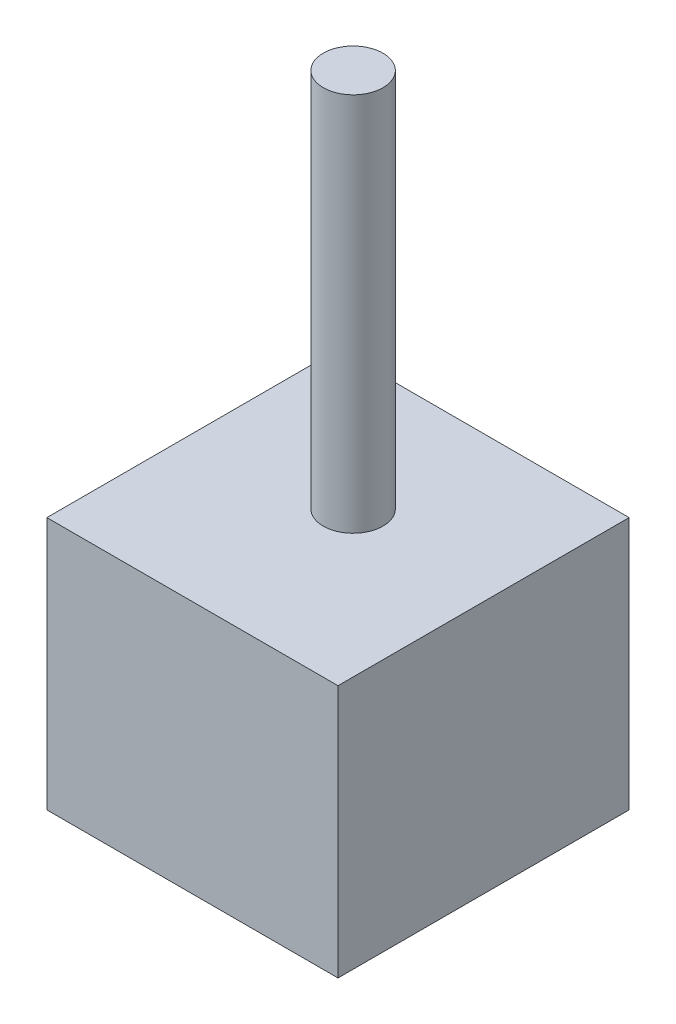
ISO-10303-21;
HEADER;
FILE_DESCRIPTION(('STEP AP214'),'2;1');
FILE_NAME('part.step','',(''),(''),'','','');
FILE_SCHEMA(('AUTOMOTIVE_DESIGN { 1 0 10303 214 1 1 1 1 }'));
ENDSEC;
DATA;
#1=APPLICATION_CONTEXT('core data for automotive mechanical design processes');
#2=APPLICATION_PROTOCOL_DEFINITION('international standard','automotive_design',2000,#1);
#3=PRODUCT_CONTEXT('',#1,'mechanical');
#4=PRODUCT('Part','Part','',(#3));
#5=PRODUCT_RELATED_PRODUCT_CATEGORY('part','',(#4));
#6=PRODUCT_DEFINITION_FORMATION('','',#4);
#7=PRODUCT_DEFINITION_CONTEXT('part definition',#1,'design');
#8=PRODUCT_DEFINITION('design','',#6,#7);
#9=PRODUCT_DEFINITION_SHAPE('','',#8);
#10=(LENGTH_UNIT() NAMED_UNIT(*) SI_UNIT(.MILLI.,.METRE.));
#11=(NAMED_UNIT(*) PLANE_ANGLE_UNIT() SI_UNIT($,.RADIAN.));
#12=(NAMED_UNIT(*) SI_UNIT($,.STERADIAN.) SOLID_ANGLE_UNIT());
#13=UNCERTAINTY_MEASURE_WITH_UNIT(LENGTH_MEASURE(1.E-05),#10,'distance_accuracy_value','');
#14=(GEOMETRIC_REPRESENTATION_CONTEXT(3) GLOBAL_UNCERTAINTY_ASSIGNED_CONTEXT((#13)) GLOBAL_UNIT_ASSIGNED_CONTEXT((#10,
#11,#12)) REPRESENTATION_CONTEXT('',''));
#15=CARTESIAN_POINT('',(0.,0.,0.));
#16=DIRECTION('',(0.,0.,1.));
#17=DIRECTION('',(1.,0.,0.));
#18=AXIS2_PLACEMENT_3D('',#15,#16,#17);
#19=CARTESIAN_POINT('',(-29.21,50.8,32.2401754385965));
#20=DIRECTION('',(1.,0.,0.));
#21=DIRECTION('',(0.,0.,-1.));
#22=AXIS2_PLACEMENT_3D('',#19,#20,#21);
#23=PLANE('',#22);
#24=DIRECTION('',(0.,0.,1.));
#25=VECTOR('',#24,1.);
#26=CARTESIAN_POINT('',(-29.21,0.,32.2401754385965));
#27=LINE('',#26,#25);
#28=CARTESIAN_POINT('',(-29.21,0.,-26.1798245614035));
#29=VERTEX_POINT('',#28);
#30=CARTESIAN_POINT('',(-29.21,0.,32.2401754385965));
#31=VERTEX_POINT('',#30);
#32=EDGE_CURVE('E110',#29,#31,#27,.T.);
#33=ORIENTED_EDGE('',*,*,#32,.T.);
#34=DIRECTION('',(0.,-1.,0.));
#35=VECTOR('',#34,1.);
#36=CARTESIAN_POINT('',(-29.21,50.8,32.2401754385965));
#37=LINE('',#36,#35);
#38=CARTESIAN_POINT('',(-29.21,50.8,32.2401754385965));
#39=VERTEX_POINT('',#38);
#40=EDGE_CURVE('E42',#39,#31,#37,.T.);
#41=ORIENTED_EDGE('',*,*,#40,.F.);
#42=DIRECTION('',(0.,0.,1.));
#43=VECTOR('',#42,1.);
#44=CARTESIAN_POINT('',(-29.21,50.8,32.2401754385965));
#45=LINE('',#44,#43);
#46=CARTESIAN_POINT('',(-29.21,50.8,-26.1798245614035));
#47=VERTEX_POINT('',#46);
#48=EDGE_CURVE('E93',#47,#39,#45,.T.);
#49=ORIENTED_EDGE('',*,*,#48,.F.);
#50=DIRECTION('',(0.,-1.,0.));
#51=VECTOR('',#50,1.);
#52=CARTESIAN_POINT('',(-29.21,50.8,-26.1798245614035));
#53=LINE('',#52,#51);
#54=EDGE_CURVE('E106',#47,#29,#53,.T.);
#55=ORIENTED_EDGE('',*,*,#54,.T.);
#56=EDGE_LOOP('',(#33,#41,#49,#55));
#57=FACE_BOUND('',#56,.T.);
#58=ADVANCED_FACE('F39',(#57),#23,.F.);
#59=CARTESIAN_POINT('',(-29.21,50.8,32.2401754385965));
#60=DIRECTION('',(0.,0.,-1.));
#61=DIRECTION('',(-1.,0.,0.));
#62=AXIS2_PLACEMENT_3D('',#59,#60,#61);
#63=PLANE('',#62);
#64=DIRECTION('',(1.,0.,0.));
#65=VECTOR('',#64,1.);
#66=CARTESIAN_POINT('',(-29.21,0.,32.2401754385965));
#67=LINE('',#66,#65);
#68=CARTESIAN_POINT('',(29.21,0.,32.2401754385965));
#69=VERTEX_POINT('',#68);
#70=EDGE_CURVE('E99',#31,#69,#67,.T.);
#71=ORIENTED_EDGE('',*,*,#70,.T.);
#72=DIRECTION('',(0.,-1.,0.));
#73=VECTOR('',#72,1.);
#74=CARTESIAN_POINT('',(29.21,50.8,32.2401754385965));
#75=LINE('',#74,#73);
#76=CARTESIAN_POINT('',(29.21,50.8,32.2401754385965));
#77=VERTEX_POINT('',#76);
#78=EDGE_CURVE('E97',#77,#69,#75,.T.);
#79=ORIENTED_EDGE('',*,*,#78,.F.);
#80=DIRECTION('',(1.,0.,0.));
#81=VECTOR('',#80,1.);
#82=CARTESIAN_POINT('',(-29.21,50.8,32.2401754385965));
#83=LINE('',#82,#81);
#84=EDGE_CURVE('E88',#39,#77,#83,.T.);
#85=ORIENTED_EDGE('',*,*,#84,.F.);
#86=ORIENTED_EDGE('',*,*,#40,.T.);
#87=EDGE_LOOP('',(#71,#79,#85,#86));
#88=FACE_BOUND('',#87,.T.);
#89=ADVANCED_FACE('F98',(#88),#63,.F.);
#90=CARTESIAN_POINT('',(29.21,50.8,32.2401754385965));
#91=DIRECTION('',(-1.,0.,0.));
#92=DIRECTION('',(0.,0.,1.));
#93=AXIS2_PLACEMENT_3D('',#90,#91,#92);
#94=PLANE('',#93);
#95=DIRECTION('',(0.,0.,-1.));
#96=VECTOR('',#95,1.);
#97=CARTESIAN_POINT('',(29.21,0.,32.2401754385965));
#98=LINE('',#97,#96);
#99=CARTESIAN_POINT('',(29.21,0.,-26.1798245614035));
#100=VERTEX_POINT('',#99);
#101=EDGE_CURVE('E74',#69,#100,#98,.T.);
#102=ORIENTED_EDGE('',*,*,#101,.T.);
#103=DIRECTION('',(0.,-1.,0.));
#104=VECTOR('',#103,1.);
#105=CARTESIAN_POINT('',(29.21,50.8,-26.1798245614035));
#106=LINE('',#105,#104);
#107=CARTESIAN_POINT('',(29.21,50.8,-26.1798245614035));
#108=VERTEX_POINT('',#107);
#109=EDGE_CURVE('E101',#108,#100,#106,.T.);
#110=ORIENTED_EDGE('',*,*,#109,.F.);
#111=DIRECTION('',(0.,0.,-1.));
#112=VECTOR('',#111,1.);
#113=CARTESIAN_POINT('',(29.21,50.8,32.2401754385965));
#114=LINE('',#113,#112);
#115=EDGE_CURVE('E91',#77,#108,#114,.T.);
#116=ORIENTED_EDGE('',*,*,#115,.F.);
#117=ORIENTED_EDGE('',*,*,#78,.T.);
#118=EDGE_LOOP('',(#102,#110,#116,#117));
#119=FACE_BOUND('',#118,.T.);
#120=ADVANCED_FACE('F102',(#119),#94,.F.);
#121=CARTESIAN_POINT('',(-29.21,50.8,-26.1798245614035));
#122=DIRECTION('',(0.,0.,1.));
#123=DIRECTION('',(1.,0.,0.));
#124=AXIS2_PLACEMENT_3D('',#121,#122,#123);
#125=PLANE('',#124);
#126=DIRECTION('',(-1.,0.,0.));
#127=VECTOR('',#126,1.);
#128=CARTESIAN_POINT('',(-29.21,0.,-26.1798245614035));
#129=LINE('',#128,#127);
#130=EDGE_CURVE('E80',#100,#29,#129,.T.);
#131=ORIENTED_EDGE('',*,*,#130,.T.);
#132=ORIENTED_EDGE('',*,*,#54,.F.);
#133=DIRECTION('',(-1.,0.,0.));
#134=VECTOR('',#133,1.);
#135=CARTESIAN_POINT('',(-29.21,50.8,-26.1798245614035));
#136=LINE('',#135,#134);
#137=EDGE_CURVE('E57',#108,#47,#136,.T.);
#138=ORIENTED_EDGE('',*,*,#137,.F.);
#139=ORIENTED_EDGE('',*,*,#109,.T.);
#140=EDGE_LOOP('',(#131,#132,#138,#139));
#141=FACE_BOUND('',#140,.T.);
#142=ADVANCED_FACE('F124',(#141),#125,.F.);
#143=CARTESIAN_POINT('',(0.,50.8,0.));
#144=DIRECTION('',(0.,-1.,0.));
#145=DIRECTION('',(0.,0.,-1.));
#146=AXIS2_PLACEMENT_3D('',#143,#144,#145);
#147=PLANE('',#146);
#148=CARTESIAN_POINT('',(0.,50.8,0.));
#149=DIRECTION('',(0.,1.,0.));
#150=DIRECTION('',(0.,0.,1.));
#151=AXIS2_PLACEMENT_3D('',#148,#149,#150);
#152=CIRCLE('',#151,6.);
#153=CARTESIAN_POINT('',(0.,50.8,6.));
#154=VERTEX_POINT('',#153);
#155=EDGE_CURVE('E11',#154,#154,#152,.T.);
#156=ORIENTED_EDGE('',*,*,#155,.F.);
#157=EDGE_LOOP('',(#156));
#158=FACE_BOUND('',#157,.T.);
#159=ORIENTED_EDGE('',*,*,#48,.T.);
#160=ORIENTED_EDGE('',*,*,#84,.T.);
#161=ORIENTED_EDGE('',*,*,#115,.T.);
#162=ORIENTED_EDGE('',*,*,#137,.T.);
#163=EDGE_LOOP('',(#159,#160,#161,#162));
#164=FACE_BOUND('',#163,.T.);
#165=ADVANCED_FACE('F89',(#158,#164),#147,.F.);
#166=CARTESIAN_POINT('',(0.,0.,0.));
#167=DIRECTION('',(0.,-1.,0.));
#168=DIRECTION('',(0.,0.,-1.));
#169=AXIS2_PLACEMENT_3D('',#166,#167,#168);
#170=PLANE('',#169);
#171=ORIENTED_EDGE('',*,*,#32,.F.);
#172=ORIENTED_EDGE('',*,*,#130,.F.);
#173=ORIENTED_EDGE('',*,*,#101,.F.);
#174=ORIENTED_EDGE('',*,*,#70,.F.);
#175=EDGE_LOOP('',(#171,#172,#173,#174));
#176=FACE_BOUND('',#175,.T.);
#177=ADVANCED_FACE('F127',(#176),#170,.T.);
#178=CARTESIAN_POINT('',(0.,127.,0.));
#179=DIRECTION('',(0.,-1.,0.));
#180=DIRECTION('',(0.,0.,-1.));
#181=AXIS2_PLACEMENT_3D('',#178,#179,#180);
#182=CYLINDRICAL_SURFACE('',#181,6.);
#183=CARTESIAN_POINT('',(0.,127.,0.));
#184=DIRECTION('',(0.,1.,0.));
#185=DIRECTION('',(0.,0.,1.));
#186=AXIS2_PLACEMENT_3D('',#183,#184,#185);
#187=CIRCLE('',#186,6.);
#188=CARTESIAN_POINT('',(0.,127.,6.));
#189=VERTEX_POINT('',#188);
#190=EDGE_CURVE('E114',#189,#189,#187,.T.);
#191=ORIENTED_EDGE('',*,*,#190,.F.);
#192=EDGE_LOOP('',(#191));
#193=FACE_BOUND('',#192,.T.);
#194=ORIENTED_EDGE('',*,*,#155,.T.);
#195=EDGE_LOOP('',(#194));
#196=FACE_BOUND('',#195,.T.);
#197=ADVANCED_FACE('F137',(#193,#196),#182,.T.);
#198=CARTESIAN_POINT('',(0.,127.,0.));
#199=DIRECTION('',(0.,1.,0.));
#200=DIRECTION('',(0.,0.,1.));
#201=AXIS2_PLACEMENT_3D('',#198,#199,#200);
#202=PLANE('',#201);
#203=ORIENTED_EDGE('',*,*,#190,.T.);
#204=EDGE_LOOP('',(#203));
#205=FACE_BOUND('',#204,.T.);
#206=ADVANCED_FACE('F135',(#205),#202,.T.);
#207=CLOSED_SHELL('',(#58,#89,#120,#142,#165,#177,#197,#206));
#208=MANIFOLD_SOLID_BREP('B2',#207);
#209=ADVANCED_BREP_SHAPE_REPRESENTATION('',(#18,#208),#14);
#210=SHAPE_DEFINITION_REPRESENTATION(#9,#209);
ENDSEC;
END-ISO-10303-21;
